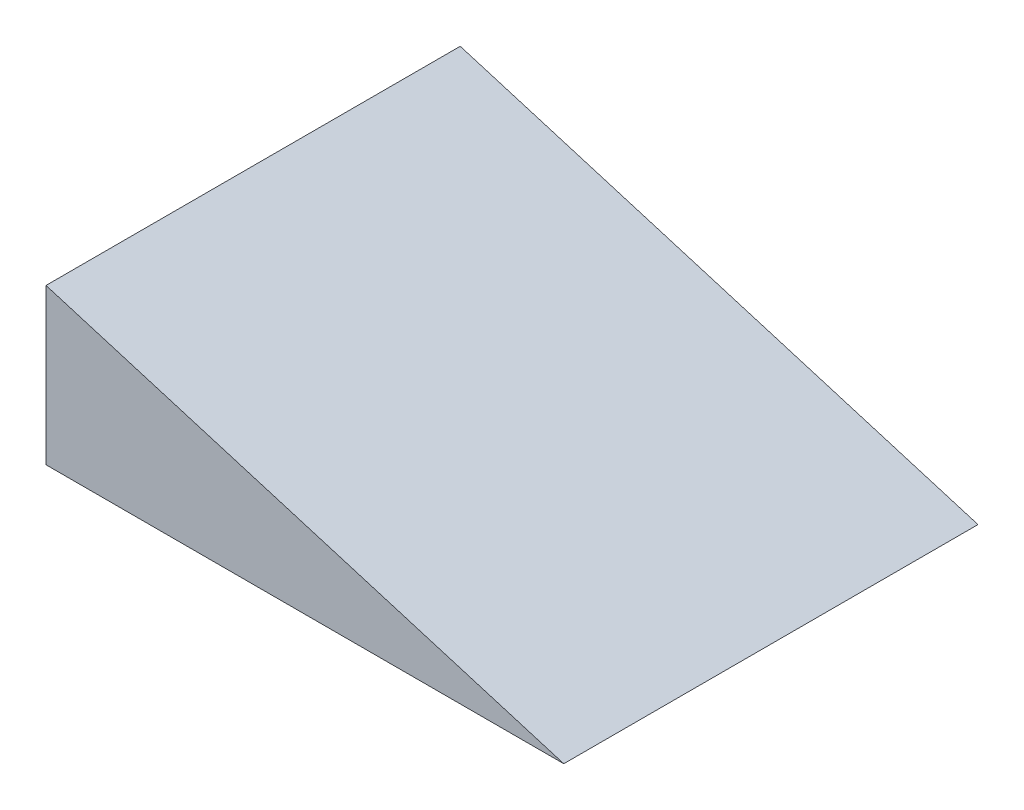
ISO-10303-21;
HEADER;
FILE_DESCRIPTION(('STEP AP214'),'2;1');
FILE_NAME('part.step','',(''),(''),'','','');
FILE_SCHEMA(('AUTOMOTIVE_DESIGN { 1 0 10303 214 1 1 1 1 }'));
ENDSEC;
DATA;
#1=APPLICATION_CONTEXT('core data for automotive mechanical design processes');
#2=APPLICATION_PROTOCOL_DEFINITION('international standard','automotive_design',2000,#1);
#3=PRODUCT_CONTEXT('',#1,'mechanical');
#4=PRODUCT('Part','Part','',(#3));
#5=PRODUCT_RELATED_PRODUCT_CATEGORY('part','',(#4));
#6=PRODUCT_DEFINITION_FORMATION('','',#4);
#7=PRODUCT_DEFINITION_CONTEXT('part definition',#1,'design');
#8=PRODUCT_DEFINITION('design','',#6,#7);
#9=PRODUCT_DEFINITION_SHAPE('','',#8);
#10=(LENGTH_UNIT() NAMED_UNIT(*) SI_UNIT(.MILLI.,.METRE.));
#11=(NAMED_UNIT(*) PLANE_ANGLE_UNIT() SI_UNIT($,.RADIAN.));
#12=(NAMED_UNIT(*) SI_UNIT($,.STERADIAN.) SOLID_ANGLE_UNIT());
#13=UNCERTAINTY_MEASURE_WITH_UNIT(LENGTH_MEASURE(1.E-05),#10,'distance_accuracy_value','');
#14=(GEOMETRIC_REPRESENTATION_CONTEXT(3) GLOBAL_UNCERTAINTY_ASSIGNED_CONTEXT((#13)) GLOBAL_UNIT_ASSIGNED_CONTEXT((#10,
#11,#12)) REPRESENTATION_CONTEXT('',''));
#15=CARTESIAN_POINT('',(0.,0.,0.));
#16=DIRECTION('',(0.,0.,1.));
#17=DIRECTION('',(1.,0.,0.));
#18=AXIS2_PLACEMENT_3D('',#15,#16,#17);
#19=CARTESIAN_POINT('',(0.,228.6,-609.6));
#20=DIRECTION('',(-1.,0.,0.));
#21=DIRECTION('',(0.,-1.,0.));
#22=AXIS2_PLACEMENT_3D('',#19,#20,#21);
#23=PLANE('',#22);
#24=DIRECTION('',(0.,-1.,0.));
#25=VECTOR('',#24,1.);
#26=CARTESIAN_POINT('',(0.,228.6,0.));
#27=LINE('',#26,#25);
#28=CARTESIAN_POINT('',(0.,228.6,0.));
#29=VERTEX_POINT('',#28);
#30=CARTESIAN_POINT('',(0.,0.,0.));
#31=VERTEX_POINT('',#30);
#32=EDGE_CURVE('E156',#29,#31,#27,.T.);
#33=ORIENTED_EDGE('',*,*,#32,.F.);
#34=DIRECTION('',(0.,0.,1.));
#35=VECTOR('',#34,1.);
#36=CARTESIAN_POINT('',(0.,228.6,-609.6));
#37=LINE('',#36,#35);
#38=CARTESIAN_POINT('',(0.,228.6,-609.6));
#39=VERTEX_POINT('',#38);
#40=EDGE_CURVE('E48',#39,#29,#37,.T.);
#41=ORIENTED_EDGE('',*,*,#40,.F.);
#42=DIRECTION('',(0.,-1.,0.));
#43=VECTOR('',#42,1.);
#44=CARTESIAN_POINT('',(0.,228.6,-609.6));
#45=LINE('',#44,#43);
#46=CARTESIAN_POINT('',(0.,0.,-609.6));
#47=VERTEX_POINT('',#46);
#48=EDGE_CURVE('E146',#39,#47,#45,.T.);
#49=ORIENTED_EDGE('',*,*,#48,.T.);
#50=DIRECTION('',(0.,0.,1.));
#51=VECTOR('',#50,1.);
#52=CARTESIAN_POINT('',(0.,0.,-609.6));
#53=LINE('',#52,#51);
#54=EDGE_CURVE('E54',#47,#31,#53,.T.);
#55=ORIENTED_EDGE('',*,*,#54,.T.);
#56=EDGE_LOOP('',(#33,#41,#49,#55));
#57=FACE_BOUND('',#56,.T.);
#58=DIRECTION('',(0.,0.,1.));
#59=VECTOR('',#58,1.);
#60=CARTESIAN_POINT('',(0.,221.970405366842,-609.6));
#61=LINE('',#60,#59);
#62=CARTESIAN_POINT('',(0.,221.970405366842,-603.25));
#63=VERTEX_POINT('',#62);
#64=CARTESIAN_POINT('',(0.,221.970405366842,-6.35));
#65=VERTEX_POINT('',#64);
#66=EDGE_CURVE('E120',#63,#65,#61,.T.);
#67=ORIENTED_EDGE('',*,*,#66,.T.);
#68=DIRECTION('',(0.,-1.,0.));
#69=VECTOR('',#68,1.);
#70=CARTESIAN_POINT('',(0.,0.,-6.35));
#71=LINE('',#70,#69);
#72=CARTESIAN_POINT('',(0.,6.35,-6.35));
#73=VERTEX_POINT('',#72);
#74=EDGE_CURVE('E138',#65,#73,#71,.T.);
#75=ORIENTED_EDGE('',*,*,#74,.T.);
#76=DIRECTION('',(0.,0.,1.));
#77=VECTOR('',#76,1.);
#78=CARTESIAN_POINT('',(0.,6.34999999999999,-609.6));
#79=LINE('',#78,#77);
#80=CARTESIAN_POINT('',(0.,6.35,-603.25));
#81=VERTEX_POINT('',#80);
#82=EDGE_CURVE('E114',#81,#73,#79,.T.);
#83=ORIENTED_EDGE('',*,*,#82,.F.);
#84=DIRECTION('',(0.,-1.,0.));
#85=VECTOR('',#84,1.);
#86=CARTESIAN_POINT('',(0.,0.,-603.25));
#87=LINE('',#86,#85);
#88=EDGE_CURVE('E124',#63,#81,#87,.T.);
#89=ORIENTED_EDGE('',*,*,#88,.F.);
#90=EDGE_LOOP('',(#67,#75,#83,#89));
#91=FACE_BOUND('',#90,.T.);
#92=ADVANCED_FACE('F44',(#57,#91),#23,.T.);
#93=CARTESIAN_POINT('',(762.,0.,-609.6));
#94=DIRECTION('',(0.287347885566345,0.957826285221151,0.));
#95=DIRECTION('',(-0.957826285221151,0.287347885566345,0.));
#96=AXIS2_PLACEMENT_3D('',#93,#94,#95);
#97=PLANE('',#96);
#98=DIRECTION('',(-0.957826285221151,0.287347885566345,0.));
#99=VECTOR('',#98,1.);
#100=CARTESIAN_POINT('',(762.,0.,0.));
#101=LINE('',#100,#99);
#102=CARTESIAN_POINT('',(762.,0.,0.));
#103=VERTEX_POINT('',#102);
#104=EDGE_CURVE('E113',#103,#29,#101,.T.);
#105=ORIENTED_EDGE('',*,*,#104,.F.);
#106=DIRECTION('',(0.,0.,1.));
#107=VECTOR('',#106,1.);
#108=CARTESIAN_POINT('',(762.,0.,-609.6));
#109=LINE('',#108,#107);
#110=CARTESIAN_POINT('',(762.,0.,-609.6));
#111=VERTEX_POINT('',#110);
#112=EDGE_CURVE('E11',#111,#103,#109,.T.);
#113=ORIENTED_EDGE('',*,*,#112,.F.);
#114=DIRECTION('',(-0.957826285221151,0.287347885566345,0.));
#115=VECTOR('',#114,1.);
#116=CARTESIAN_POINT('',(762.,0.,-609.6));
#117=LINE('',#116,#115);
#118=EDGE_CURVE('E143',#111,#39,#117,.T.);
#119=ORIENTED_EDGE('',*,*,#118,.T.);
#120=ORIENTED_EDGE('',*,*,#40,.T.);
#121=EDGE_LOOP('',(#105,#113,#119,#120));
#122=FACE_BOUND('',#121,.T.);
#123=ADVANCED_FACE('F46',(#122),#97,.T.);
#124=CARTESIAN_POINT('',(0.,0.,-609.6));
#125=DIRECTION('',(0.,-1.,0.));
#126=DIRECTION('',(0.,0.,-1.));
#127=AXIS2_PLACEMENT_3D('',#124,#125,#126);
#128=PLANE('',#127);
#129=DIRECTION('',(1.,0.,0.));
#130=VECTOR('',#129,1.);
#131=CARTESIAN_POINT('',(0.,0.,0.));
#132=LINE('',#131,#130);
#133=EDGE_CURVE('E147',#31,#103,#132,.T.);
#134=ORIENTED_EDGE('',*,*,#133,.F.);
#135=ORIENTED_EDGE('',*,*,#54,.F.);
#136=DIRECTION('',(1.,0.,0.));
#137=VECTOR('',#136,1.);
#138=CARTESIAN_POINT('',(0.,0.,-609.6));
#139=LINE('',#138,#137);
#140=EDGE_CURVE('E150',#47,#111,#139,.T.);
#141=ORIENTED_EDGE('',*,*,#140,.T.);
#142=ORIENTED_EDGE('',*,*,#112,.T.);
#143=EDGE_LOOP('',(#134,#135,#141,#142));
#144=FACE_BOUND('',#143,.T.);
#145=ADVANCED_FACE('F167',(#144),#128,.T.);
#146=CARTESIAN_POINT('',(0.,0.,-609.6));
#147=DIRECTION('',(0.,0.,1.));
#148=DIRECTION('',(1.,0.,0.));
#149=AXIS2_PLACEMENT_3D('',#146,#147,#148);
#150=PLANE('',#149);
#151=ORIENTED_EDGE('',*,*,#118,.F.);
#152=ORIENTED_EDGE('',*,*,#140,.F.);
#153=ORIENTED_EDGE('',*,*,#48,.F.);
#154=EDGE_LOOP('',(#151,#152,#153));
#155=FACE_BOUND('',#154,.T.);
#156=ADVANCED_FACE('F170',(#155),#150,.F.);
#157=CARTESIAN_POINT('',(0.,0.,0.));
#158=DIRECTION('',(0.,0.,1.));
#159=DIRECTION('',(1.,0.,0.));
#160=AXIS2_PLACEMENT_3D('',#157,#158,#159);
#161=PLANE('',#160);
#162=ORIENTED_EDGE('',*,*,#104,.T.);
#163=ORIENTED_EDGE('',*,*,#32,.T.);
#164=ORIENTED_EDGE('',*,*,#133,.T.);
#165=EDGE_LOOP('',(#162,#163,#164));
#166=FACE_BOUND('',#165,.T.);
#167=ADVANCED_FACE('F166',(#166),#161,.T.);
#168=CARTESIAN_POINT('',(760.175340926654,-6.08219691115431,-609.6));
#169=DIRECTION('',(0.287347885566345,0.957826285221151,0.));
#170=DIRECTION('',(-0.957826285221151,0.287347885566345,0.));
#171=AXIS2_PLACEMENT_3D('',#168,#169,#170);
#172=PLANE('',#171);
#173=DIRECTION('',(-0.957826285221151,0.287347885566345,0.));
#174=VECTOR('',#173,1.);
#175=CARTESIAN_POINT('',(61.0927721193143,203.642573731048,-6.35));
#176=LINE('',#175,#174);
#177=CARTESIAN_POINT('',(718.734684556139,6.35,-6.35));
#178=VERTEX_POINT('',#177);
#179=EDGE_CURVE('E142',#178,#65,#176,.T.);
#180=ORIENTED_EDGE('',*,*,#179,.T.);
#181=ORIENTED_EDGE('',*,*,#66,.F.);
#182=DIRECTION('',(-0.957826285221151,0.287347885566345,0.));
#183=VECTOR('',#182,1.);
#184=CARTESIAN_POINT('',(61.0927721193143,203.642573731048,-603.25));
#185=LINE('',#184,#183);
#186=CARTESIAN_POINT('',(718.734684556139,6.35,-603.25));
#187=VERTEX_POINT('',#186);
#188=EDGE_CURVE('E117',#187,#63,#185,.T.);
#189=ORIENTED_EDGE('',*,*,#188,.F.);
#190=DIRECTION('',(0.,0.,1.));
#191=VECTOR('',#190,1.);
#192=CARTESIAN_POINT('',(718.734684556139,6.35,-609.6));
#193=LINE('',#192,#191);
#194=EDGE_CURVE('E104',#187,#178,#193,.T.);
#195=ORIENTED_EDGE('',*,*,#194,.T.);
#196=EDGE_LOOP('',(#180,#181,#189,#195));
#197=FACE_BOUND('',#196,.T.);
#198=ADVANCED_FACE('F118',(#197),#172,.F.);
#199=CARTESIAN_POINT('',(0.,6.35,-609.6));
#200=DIRECTION('',(0.,-1.,0.));
#201=DIRECTION('',(0.,0.,-1.));
#202=AXIS2_PLACEMENT_3D('',#199,#200,#201);
#203=PLANE('',#202);
#204=DIRECTION('',(1.,0.,0.));
#205=VECTOR('',#204,1.);
#206=CARTESIAN_POINT('',(0.,6.35,-6.35));
#207=LINE('',#206,#205);
#208=EDGE_CURVE('E108',#73,#178,#207,.T.);
#209=ORIENTED_EDGE('',*,*,#208,.T.);
#210=ORIENTED_EDGE('',*,*,#194,.F.);
#211=DIRECTION('',(1.,0.,0.));
#212=VECTOR('',#211,1.);
#213=CARTESIAN_POINT('',(0.,6.35,-603.25));
#214=LINE('',#213,#212);
#215=EDGE_CURVE('E62',#81,#187,#214,.T.);
#216=ORIENTED_EDGE('',*,*,#215,.F.);
#217=ORIENTED_EDGE('',*,*,#82,.T.);
#218=EDGE_LOOP('',(#209,#210,#216,#217));
#219=FACE_BOUND('',#218,.T.);
#220=ADVANCED_FACE('F106',(#219),#203,.F.);
#221=CARTESIAN_POINT('',(0.,0.,-603.25));
#222=DIRECTION('',(0.,0.,1.));
#223=DIRECTION('',(1.,0.,0.));
#224=AXIS2_PLACEMENT_3D('',#221,#222,#223);
#225=PLANE('',#224);
#226=ORIENTED_EDGE('',*,*,#188,.T.);
#227=ORIENTED_EDGE('',*,*,#88,.T.);
#228=ORIENTED_EDGE('',*,*,#215,.T.);
#229=EDGE_LOOP('',(#226,#227,#228));
#230=FACE_BOUND('',#229,.T.);
#231=ADVANCED_FACE('F126',(#230),#225,.T.);
#232=CARTESIAN_POINT('',(0.,0.,-6.35));
#233=DIRECTION('',(0.,0.,1.));
#234=DIRECTION('',(1.,0.,0.));
#235=AXIS2_PLACEMENT_3D('',#232,#233,#234);
#236=PLANE('',#235);
#237=ORIENTED_EDGE('',*,*,#179,.F.);
#238=ORIENTED_EDGE('',*,*,#208,.F.);
#239=ORIENTED_EDGE('',*,*,#74,.F.);
#240=EDGE_LOOP('',(#237,#238,#239));
#241=FACE_BOUND('',#240,.T.);
#242=ADVANCED_FACE('F196',(#241),#236,.F.);
#243=CLOSED_SHELL('',(#92,#123,#145,#156,#167,#198,#220,#231,#242));
#244=MANIFOLD_SOLID_BREP('B2',#243);
#245=ADVANCED_BREP_SHAPE_REPRESENTATION('',(#18,#244),#14);
#246=SHAPE_DEFINITION_REPRESENTATION(#9,#245);
ENDSEC;
END-ISO-10303-21;
